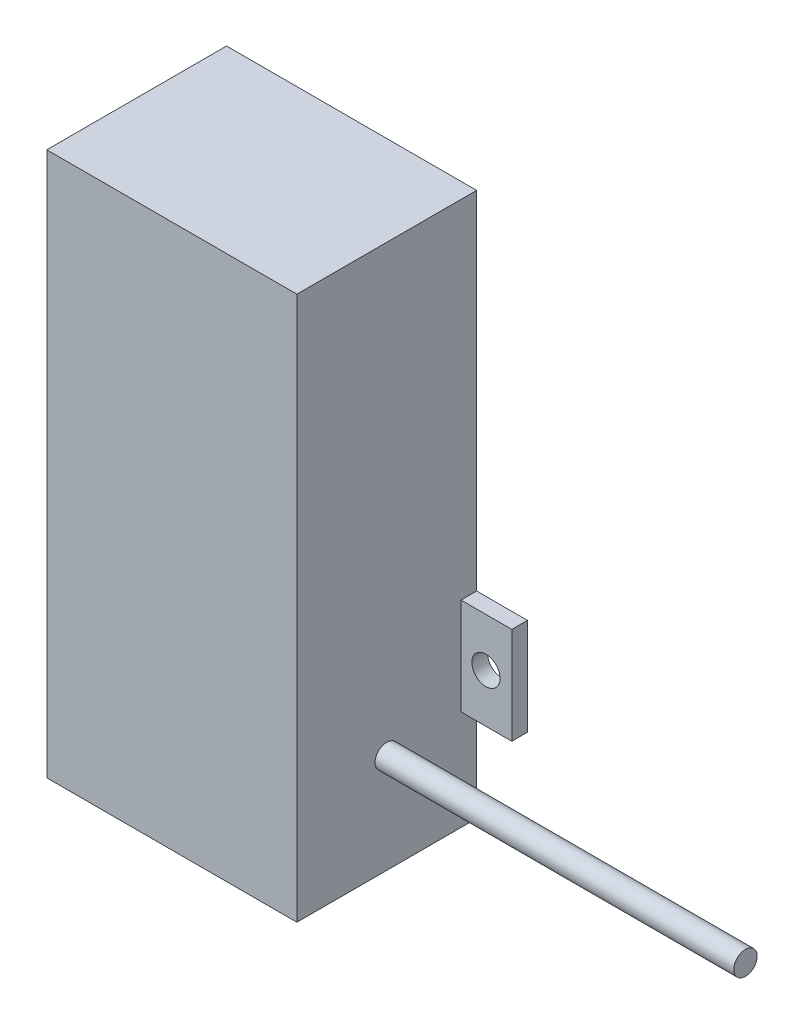
ISO-10303-21;
HEADER;
FILE_DESCRIPTION(('STEP AP214'),'2;1');
FILE_NAME('part.step','',(''),(''),'','','');
FILE_SCHEMA(('AUTOMOTIVE_DESIGN { 1 0 10303 214 1 1 1 1 }'));
ENDSEC;
DATA;
#1=APPLICATION_CONTEXT('core data for automotive mechanical design processes');
#2=APPLICATION_PROTOCOL_DEFINITION('international standard','automotive_design',2000,#1);
#3=PRODUCT_CONTEXT('',#1,'mechanical');
#4=PRODUCT('Part','Part','',(#3));
#5=PRODUCT_RELATED_PRODUCT_CATEGORY('part','',(#4));
#6=PRODUCT_DEFINITION_FORMATION('','',#4);
#7=PRODUCT_DEFINITION_CONTEXT('part definition',#1,'design');
#8=PRODUCT_DEFINITION('design','',#6,#7);
#9=PRODUCT_DEFINITION_SHAPE('','',#8);
#10=(LENGTH_UNIT() NAMED_UNIT(*) SI_UNIT(.MILLI.,.METRE.));
#11=(NAMED_UNIT(*) PLANE_ANGLE_UNIT() SI_UNIT($,.RADIAN.));
#12=(NAMED_UNIT(*) SI_UNIT($,.STERADIAN.) SOLID_ANGLE_UNIT());
#13=UNCERTAINTY_MEASURE_WITH_UNIT(LENGTH_MEASURE(1.E-05),#10,'distance_accuracy_value','');
#14=(GEOMETRIC_REPRESENTATION_CONTEXT(3) GLOBAL_UNCERTAINTY_ASSIGNED_CONTEXT((#13)) GLOBAL_UNIT_ASSIGNED_CONTEXT((#10,
#11,#12)) REPRESENTATION_CONTEXT('',''));
#15=CARTESIAN_POINT('',(0.,0.,0.));
#16=DIRECTION('',(0.,0.,1.));
#17=DIRECTION('',(1.,0.,0.));
#18=AXIS2_PLACEMENT_3D('',#15,#16,#17);
#19=CARTESIAN_POINT('',(34.2790620031797,29.2729411764706,23.));
#20=DIRECTION('',(-1.,0.,0.));
#21=DIRECTION('',(0.,0.,1.));
#22=AXIS2_PLACEMENT_3D('',#19,#20,#21);
#23=PLANE('',#22);
#24=DIRECTION('',(0.,-1.,0.));
#25=VECTOR('',#24,1.);
#26=CARTESIAN_POINT('',(34.2790620031797,-19.5220896505135,2.));
#27=LINE('',#26,#25);
#28=CARTESIAN_POINT('',(34.2790620031797,-15.1220896505135,2.));
#29=VERTEX_POINT('',#28);
#30=CARTESIAN_POINT('',(34.2790620031797,-28.4172027618297,2.));
#31=VERTEX_POINT('',#30);
#32=EDGE_CURVE('E157',#29,#31,#27,.T.);
#33=ORIENTED_EDGE('',*,*,#32,.T.);
#34=DIRECTION('',(0.,0.,1.));
#35=VECTOR('',#34,1.);
#36=CARTESIAN_POINT('',(34.2790620031797,-28.4172027618297,23.));
#37=LINE('',#36,#35);
#38=CARTESIAN_POINT('',(34.2790620031797,-28.4172027618297,0.));
#39=VERTEX_POINT('',#38);
#40=EDGE_CURVE('E11',#39,#31,#37,.T.);
#41=ORIENTED_EDGE('',*,*,#40,.F.);
#42=DIRECTION('',(0.,1.,0.));
#43=VECTOR('',#42,1.);
#44=CARTESIAN_POINT('',(34.2790620031797,29.2729411764706,0.));
#45=LINE('',#44,#43);
#46=CARTESIAN_POINT('',(34.2790620031797,-40.3270588235294,0.));
#47=VERTEX_POINT('',#46);
#48=EDGE_CURVE('E143',#47,#39,#45,.T.);
#49=ORIENTED_EDGE('',*,*,#48,.F.);
#50=DIRECTION('',(0.,0.,-1.));
#51=VECTOR('',#50,1.);
#52=CARTESIAN_POINT('',(34.2790620031797,-40.3270588235294,23.));
#53=LINE('',#52,#51);
#54=CARTESIAN_POINT('',(34.2790620031797,-40.3270588235294,23.));
#55=VERTEX_POINT('',#54);
#56=EDGE_CURVE('E171',#55,#47,#53,.T.);
#57=ORIENTED_EDGE('',*,*,#56,.F.);
#58=DIRECTION('',(0.,1.,0.));
#59=VECTOR('',#58,1.);
#60=CARTESIAN_POINT('',(34.2790620031797,29.2729411764706,23.));
#61=LINE('',#60,#59);
#62=CARTESIAN_POINT('',(34.2790620031797,29.2729411764706,23.));
#63=VERTEX_POINT('',#62);
#64=EDGE_CURVE('E168',#55,#63,#61,.T.);
#65=ORIENTED_EDGE('',*,*,#64,.T.);
#66=DIRECTION('',(0.,0.,-1.));
#67=VECTOR('',#66,1.);
#68=CARTESIAN_POINT('',(34.2790620031797,29.2729411764706,23.));
#69=LINE('',#68,#67);
#70=CARTESIAN_POINT('',(34.2790620031797,29.2729411764706,0.));
#71=VERTEX_POINT('',#70);
#72=EDGE_CURVE('E175',#63,#71,#69,.T.);
#73=ORIENTED_EDGE('',*,*,#72,.T.);
#74=CARTESIAN_POINT('',(34.2790620031797,-15.1220896505135,0.));
#75=VERTEX_POINT('',#74);
#76=EDGE_CURVE('E167',#75,#71,#45,.T.);
#77=ORIENTED_EDGE('',*,*,#76,.F.);
#78=DIRECTION('',(0.,0.,1.));
#79=VECTOR('',#78,1.);
#80=CARTESIAN_POINT('',(34.2790620031797,-15.1220896505135,0.));
#81=LINE('',#80,#79);
#82=EDGE_CURVE('E58',#75,#29,#81,.T.);
#83=ORIENTED_EDGE('',*,*,#82,.T.);
#84=EDGE_LOOP('',(#33,#41,#49,#57,#65,#73,#77,#83));
#85=FACE_BOUND('',#84,.T.);
#86=ADVANCED_FACE('F39',(#85),#23,.T.);
#87=CARTESIAN_POINT('',(66.2790620031797,29.2729411764706,23.));
#88=DIRECTION('',(-1.,0.,0.));
#89=DIRECTION('',(0.,0.,1.));
#90=AXIS2_PLACEMENT_3D('',#87,#88,#89);
#91=PLANE('',#90);
#92=CARTESIAN_POINT('',(66.2790620031797,-27.6270588235294,11.5));
#93=DIRECTION('',(-1.,0.,0.));
#94=DIRECTION('',(0.,0.,1.));
#95=AXIS2_PLACEMENT_3D('',#92,#93,#94);
#96=CIRCLE('',#95,1.5);
#97=CARTESIAN_POINT('',(66.2790620031797,-27.6270588235294,13.));
#98=VERTEX_POINT('',#97);
#99=EDGE_CURVE('E47',#98,#98,#96,.F.);
#100=ORIENTED_EDGE('',*,*,#99,.F.);
#101=EDGE_LOOP('',(#100));
#102=FACE_BOUND('',#101,.T.);
#103=DIRECTION('',(0.,0.,1.));
#104=VECTOR('',#103,1.);
#105=CARTESIAN_POINT('',(66.2790620031797,-27.5220896505135,0.));
#106=LINE('',#105,#104);
#107=CARTESIAN_POINT('',(66.2790620031797,-27.5220896505135,0.));
#108=VERTEX_POINT('',#107);
#109=CARTESIAN_POINT('',(66.2790620031797,-27.5220896505135,2.));
#110=VERTEX_POINT('',#109);
#111=EDGE_CURVE('E178',#108,#110,#106,.T.);
#112=ORIENTED_EDGE('',*,*,#111,.T.);
#113=DIRECTION('',(0.,-1.,0.));
#114=VECTOR('',#113,1.);
#115=CARTESIAN_POINT('',(66.2790620031797,-19.5220896505135,2.));
#116=LINE('',#115,#114);
#117=CARTESIAN_POINT('',(66.2790620031797,-15.1220896505135,2.));
#118=VERTEX_POINT('',#117);
#119=EDGE_CURVE('E195',#118,#110,#116,.T.);
#120=ORIENTED_EDGE('',*,*,#119,.F.);
#121=DIRECTION('',(0.,0.,1.));
#122=VECTOR('',#121,1.);
#123=CARTESIAN_POINT('',(66.2790620031797,-15.1220896505135,0.));
#124=LINE('',#123,#122);
#125=CARTESIAN_POINT('',(66.2790620031797,-15.1220896505135,0.));
#126=VERTEX_POINT('',#125);
#127=EDGE_CURVE('E190',#126,#118,#124,.T.);
#128=ORIENTED_EDGE('',*,*,#127,.F.);
#129=DIRECTION('',(0.,1.,0.));
#130=VECTOR('',#129,1.);
#131=CARTESIAN_POINT('',(66.2790620031797,29.2729411764706,0.));
#132=LINE('',#131,#130);
#133=CARTESIAN_POINT('',(66.2790620031797,29.2729411764706,0.));
#134=VERTEX_POINT('',#133);
#135=EDGE_CURVE('E219',#126,#134,#132,.T.);
#136=ORIENTED_EDGE('',*,*,#135,.T.);
#137=DIRECTION('',(0.,0.,-1.));
#138=VECTOR('',#137,1.);
#139=CARTESIAN_POINT('',(66.2790620031797,29.2729411764706,23.));
#140=LINE('',#139,#138);
#141=CARTESIAN_POINT('',(66.2790620031797,29.2729411764706,23.));
#142=VERTEX_POINT('',#141);
#143=EDGE_CURVE('E217',#142,#134,#140,.T.);
#144=ORIENTED_EDGE('',*,*,#143,.F.);
#145=DIRECTION('',(0.,1.,0.));
#146=VECTOR('',#145,1.);
#147=CARTESIAN_POINT('',(66.2790620031797,29.2729411764706,23.));
#148=LINE('',#147,#146);
#149=CARTESIAN_POINT('',(66.2790620031797,-40.3270588235294,23.));
#150=VERTEX_POINT('',#149);
#151=EDGE_CURVE('E212',#150,#142,#148,.T.);
#152=ORIENTED_EDGE('',*,*,#151,.F.);
#153=DIRECTION('',(0.,0.,-1.));
#154=VECTOR('',#153,1.);
#155=CARTESIAN_POINT('',(66.2790620031797,-40.3270588235294,23.));
#156=LINE('',#155,#154);
#157=CARTESIAN_POINT('',(66.2790620031797,-40.3270588235294,0.));
#158=VERTEX_POINT('',#157);
#159=EDGE_CURVE('E226',#150,#158,#156,.T.);
#160=ORIENTED_EDGE('',*,*,#159,.T.);
#161=EDGE_CURVE('E220',#158,#108,#132,.T.);
#162=ORIENTED_EDGE('',*,*,#161,.T.);
#163=EDGE_LOOP('',(#112,#120,#128,#136,#144,#152,#160,#162));
#164=FACE_BOUND('',#163,.T.);
#165=ADVANCED_FACE('F233',(#102,#164),#91,.F.);
#166=CARTESIAN_POINT('',(0.,0.,0.));
#167=DIRECTION('',(0.,0.,1.));
#168=DIRECTION('',(1.,0.,0.));
#169=AXIS2_PLACEMENT_3D('',#166,#167,#168);
#170=PLANE('',#169);
#171=CARTESIAN_POINT('',(31.0771714081852,-21.7720896505135,0.));
#172=DIRECTION('',(0.,0.,1.));
#173=DIRECTION('',(1.,0.,0.));
#174=AXIS2_PLACEMENT_3D('',#171,#172,#173);
#175=CIRCLE('',#174,1.79810940500553);
#176=CARTESIAN_POINT('',(32.8752808131908,-21.7720896505135,0.));
#177=VERTEX_POINT('',#176);
#178=EDGE_CURVE('E309',#177,#177,#175,.T.);
#179=ORIENTED_EDGE('',*,*,#178,.T.);
#180=EDGE_LOOP('',(#179));
#181=FACE_BOUND('',#180,.T.);
#182=ORIENTED_EDGE('',*,*,#48,.T.);
#183=DIRECTION('',(-1.,0.,0.));
#184=VECTOR('',#183,1.);
#185=CARTESIAN_POINT('',(35.2790620031797,-28.4172027618297,0.));
#186=LINE('',#185,#184);
#187=CARTESIAN_POINT('',(27.7790620031797,-28.4172027618297,0.));
#188=VERTEX_POINT('',#187);
#189=EDGE_CURVE('E140',#39,#188,#186,.T.);
#190=ORIENTED_EDGE('',*,*,#189,.T.);
#191=DIRECTION('',(0.,1.,0.));
#192=VECTOR('',#191,1.);
#193=CARTESIAN_POINT('',(27.7790620031797,-19.5220896505135,0.));
#194=LINE('',#193,#192);
#195=CARTESIAN_POINT('',(27.7790620031797,-15.1220896505135,0.));
#196=VERTEX_POINT('',#195);
#197=EDGE_CURVE('E127',#188,#196,#194,.T.);
#198=ORIENTED_EDGE('',*,*,#197,.T.);
#199=DIRECTION('',(1.,0.,0.));
#200=VECTOR('',#199,1.);
#201=CARTESIAN_POINT('',(27.7790620031797,-15.1220896505135,0.));
#202=LINE('',#201,#200);
#203=EDGE_CURVE('E161',#196,#75,#202,.T.);
#204=ORIENTED_EDGE('',*,*,#203,.T.);
#205=ORIENTED_EDGE('',*,*,#76,.T.);
#206=DIRECTION('',(-1.,0.,0.));
#207=VECTOR('',#206,1.);
#208=CARTESIAN_POINT('',(34.2790620031797,29.2729411764706,0.));
#209=LINE('',#208,#207);
#210=EDGE_CURVE('E213',#134,#71,#209,.T.);
#211=ORIENTED_EDGE('',*,*,#210,.F.);
#212=ORIENTED_EDGE('',*,*,#135,.F.);
#213=DIRECTION('',(-1.,0.,0.));
#214=VECTOR('',#213,1.);
#215=CARTESIAN_POINT('',(72.7790620031797,-15.1220896505135,0.));
#216=LINE('',#215,#214);
#217=CARTESIAN_POINT('',(72.7790620031797,-15.1220896505135,0.));
#218=VERTEX_POINT('',#217);
#219=EDGE_CURVE('E204',#218,#126,#216,.T.);
#220=ORIENTED_EDGE('',*,*,#219,.F.);
#221=DIRECTION('',(0.,1.,0.));
#222=VECTOR('',#221,1.);
#223=CARTESIAN_POINT('',(72.7790620031797,-19.5220896505135,0.));
#224=LINE('',#223,#222);
#225=CARTESIAN_POINT('',(72.7790620031797,-27.5220896505135,0.));
#226=VERTEX_POINT('',#225);
#227=EDGE_CURVE('E191',#226,#218,#224,.T.);
#228=ORIENTED_EDGE('',*,*,#227,.F.);
#229=DIRECTION('',(-1.,0.,0.));
#230=VECTOR('',#229,1.);
#231=CARTESIAN_POINT('',(72.7790620031797,-27.5220896505135,0.));
#232=LINE('',#231,#230);
#233=EDGE_CURVE('E182',#226,#108,#232,.T.);
#234=ORIENTED_EDGE('',*,*,#233,.T.);
#235=ORIENTED_EDGE('',*,*,#161,.F.);
#236=DIRECTION('',(1.,0.,0.));
#237=VECTOR('',#236,1.);
#238=CARTESIAN_POINT('',(34.2790620031797,-40.3270588235294,0.));
#239=LINE('',#238,#237);
#240=EDGE_CURVE('E209',#47,#158,#239,.T.);
#241=ORIENTED_EDGE('',*,*,#240,.F.);
#242=EDGE_LOOP('',(#182,#190,#198,#204,#205,#211,#212,#220,#228,#234,#235,#241));
#243=FACE_BOUND('',#242,.T.);
#244=CARTESIAN_POINT('',(69.4772948209206,-21.3220896505135,0.));
#245=DIRECTION('',(0.,0.,1.));
#246=DIRECTION('',(1.,0.,0.));
#247=AXIS2_PLACEMENT_3D('',#244,#245,#246);
#248=CIRCLE('',#247,1.80176718225915);
#249=CARTESIAN_POINT('',(71.2790620031797,-21.3220896505135,0.));
#250=VERTEX_POINT('',#249);
#251=EDGE_CURVE('E150',#250,#250,#248,.T.);
#252=ORIENTED_EDGE('',*,*,#251,.T.);
#253=EDGE_LOOP('',(#252));
#254=FACE_BOUND('',#253,.T.);
#255=ADVANCED_FACE('F141',(#181,#243,#254),#170,.F.);
#256=CARTESIAN_POINT('',(34.2790620031797,-40.3270588235294,23.));
#257=DIRECTION('',(0.,1.,0.));
#258=DIRECTION('',(0.,0.,1.));
#259=AXIS2_PLACEMENT_3D('',#256,#257,#258);
#260=PLANE('',#259);
#261=DIRECTION('',(1.,0.,0.));
#262=VECTOR('',#261,1.);
#263=CARTESIAN_POINT('',(34.2790620031797,-40.3270588235294,23.));
#264=LINE('',#263,#262);
#265=EDGE_CURVE('E210',#55,#150,#264,.T.);
#266=ORIENTED_EDGE('',*,*,#265,.F.);
#267=ORIENTED_EDGE('',*,*,#56,.T.);
#268=ORIENTED_EDGE('',*,*,#240,.T.);
#269=ORIENTED_EDGE('',*,*,#159,.F.);
#270=EDGE_LOOP('',(#266,#267,#268,#269));
#271=FACE_BOUND('',#270,.T.);
#272=ADVANCED_FACE('F41',(#271),#260,.F.);
#273=CARTESIAN_POINT('',(34.2790620031797,29.2729411764706,23.));
#274=DIRECTION('',(0.,-1.,0.));
#275=DIRECTION('',(0.,0.,-1.));
#276=AXIS2_PLACEMENT_3D('',#273,#274,#275);
#277=PLANE('',#276);
#278=ORIENTED_EDGE('',*,*,#210,.T.);
#279=ORIENTED_EDGE('',*,*,#72,.F.);
#280=DIRECTION('',(-1.,0.,0.));
#281=VECTOR('',#280,1.);
#282=CARTESIAN_POINT('',(34.2790620031797,29.2729411764706,23.));
#283=LINE('',#282,#281);
#284=EDGE_CURVE('E215',#142,#63,#283,.T.);
#285=ORIENTED_EDGE('',*,*,#284,.F.);
#286=ORIENTED_EDGE('',*,*,#143,.T.);
#287=EDGE_LOOP('',(#278,#279,#285,#286));
#288=FACE_BOUND('',#287,.T.);
#289=ADVANCED_FACE('F257',(#288),#277,.F.);
#290=CARTESIAN_POINT('',(0.,0.,23.));
#291=DIRECTION('',(0.,0.,1.));
#292=DIRECTION('',(1.,0.,0.));
#293=AXIS2_PLACEMENT_3D('',#290,#291,#292);
#294=PLANE('',#293);
#295=ORIENTED_EDGE('',*,*,#284,.T.);
#296=ORIENTED_EDGE('',*,*,#64,.F.);
#297=ORIENTED_EDGE('',*,*,#265,.T.);
#298=ORIENTED_EDGE('',*,*,#151,.T.);
#299=EDGE_LOOP('',(#295,#296,#297,#298));
#300=FACE_BOUND('',#299,.T.);
#301=ADVANCED_FACE('F262',(#300),#294,.T.);
#302=CARTESIAN_POINT('',(112.17906200318,-27.6270588235294,11.5));
#303=DIRECTION('',(-1.,0.,0.));
#304=DIRECTION('',(0.,0.,1.));
#305=AXIS2_PLACEMENT_3D('',#302,#303,#304);
#306=CYLINDRICAL_SURFACE('',#305,1.5);
#307=CARTESIAN_POINT('',(112.17906200318,-27.6270588235294,11.5));
#308=DIRECTION('',(1.,0.,0.));
#309=DIRECTION('',(0.,0.,-1.));
#310=AXIS2_PLACEMENT_3D('',#307,#308,#309);
#311=CIRCLE('',#310,1.5);
#312=CARTESIAN_POINT('',(112.17906200318,-27.6270588235294,10.));
#313=VERTEX_POINT('',#312);
#314=EDGE_CURVE('E206',#313,#313,#311,.T.);
#315=ORIENTED_EDGE('',*,*,#314,.F.);
#316=EDGE_LOOP('',(#315));
#317=FACE_BOUND('',#316,.T.);
#318=ORIENTED_EDGE('',*,*,#99,.T.);
#319=EDGE_LOOP('',(#318));
#320=FACE_BOUND('',#319,.T.);
#321=ADVANCED_FACE('F231',(#317,#320),#306,.T.);
#322=CARTESIAN_POINT('',(112.17906200318,0.,0.));
#323=DIRECTION('',(1.,0.,0.));
#324=DIRECTION('',(0.,0.,-1.));
#325=AXIS2_PLACEMENT_3D('',#322,#323,#324);
#326=PLANE('',#325);
#327=ORIENTED_EDGE('',*,*,#314,.T.);
#328=EDGE_LOOP('',(#327));
#329=FACE_BOUND('',#328,.T.);
#330=ADVANCED_FACE('F332',(#329),#326,.T.);
#331=CARTESIAN_POINT('',(72.7790620031797,-15.1220896505135,0.));
#332=DIRECTION('',(0.,-1.,0.));
#333=DIRECTION('',(0.,0.,-1.));
#334=AXIS2_PLACEMENT_3D('',#331,#332,#333);
#335=PLANE('',#334);
#336=ORIENTED_EDGE('',*,*,#127,.T.);
#337=DIRECTION('',(-1.,0.,0.));
#338=VECTOR('',#337,1.);
#339=CARTESIAN_POINT('',(72.7790620031797,-15.1220896505135,2.));
#340=LINE('',#339,#338);
#341=CARTESIAN_POINT('',(72.7790620031797,-15.1220896505135,2.));
#342=VERTEX_POINT('',#341);
#343=EDGE_CURVE('E199',#342,#118,#340,.T.);
#344=ORIENTED_EDGE('',*,*,#343,.F.);
#345=DIRECTION('',(0.,0.,1.));
#346=VECTOR('',#345,1.);
#347=CARTESIAN_POINT('',(72.7790620031797,-15.1220896505135,0.));
#348=LINE('',#347,#346);
#349=EDGE_CURVE('E194',#218,#342,#348,.T.);
#350=ORIENTED_EDGE('',*,*,#349,.F.);
#351=ORIENTED_EDGE('',*,*,#219,.T.);
#352=EDGE_LOOP('',(#336,#344,#350,#351));
#353=FACE_BOUND('',#352,.T.);
#354=ADVANCED_FACE('F250',(#353),#335,.F.);
#355=CARTESIAN_POINT('',(72.7790620031797,-19.5220896505135,2.));
#356=DIRECTION('',(0.,0.,-1.));
#357=DIRECTION('',(-1.,0.,0.));
#358=AXIS2_PLACEMENT_3D('',#355,#356,#357);
#359=PLANE('',#358);
#360=CARTESIAN_POINT('',(69.4772948209206,-21.3220896505135,2.));
#361=DIRECTION('',(0.,0.,1.));
#362=DIRECTION('',(1.,0.,0.));
#363=AXIS2_PLACEMENT_3D('',#360,#361,#362);
#364=CIRCLE('',#363,1.80176718225915);
#365=CARTESIAN_POINT('',(71.2790620031797,-21.3220896505135,2.));
#366=VERTEX_POINT('',#365);
#367=EDGE_CURVE('E153',#366,#366,#364,.T.);
#368=ORIENTED_EDGE('',*,*,#367,.F.);
#369=EDGE_LOOP('',(#368));
#370=FACE_BOUND('',#369,.T.);
#371=ORIENTED_EDGE('',*,*,#119,.T.);
#372=DIRECTION('',(-1.,0.,0.));
#373=VECTOR('',#372,1.);
#374=CARTESIAN_POINT('',(72.7790620031797,-27.5220896505135,2.));
#375=LINE('',#374,#373);
#376=CARTESIAN_POINT('',(72.7790620031797,-27.5220896505135,2.));
#377=VERTEX_POINT('',#376);
#378=EDGE_CURVE('E187',#377,#110,#375,.T.);
#379=ORIENTED_EDGE('',*,*,#378,.F.);
#380=DIRECTION('',(0.,-1.,0.));
#381=VECTOR('',#380,1.);
#382=CARTESIAN_POINT('',(72.7790620031797,-19.5220896505135,2.));
#383=LINE('',#382,#381);
#384=EDGE_CURVE('E197',#342,#377,#383,.T.);
#385=ORIENTED_EDGE('',*,*,#384,.F.);
#386=ORIENTED_EDGE('',*,*,#343,.T.);
#387=EDGE_LOOP('',(#371,#379,#385,#386));
#388=FACE_BOUND('',#387,.T.);
#389=ADVANCED_FACE('F247',(#370,#388),#359,.F.);
#390=CARTESIAN_POINT('',(72.7790620031797,0.,0.));
#391=DIRECTION('',(1.,0.,0.));
#392=DIRECTION('',(0.,0.,-1.));
#393=AXIS2_PLACEMENT_3D('',#390,#391,#392);
#394=PLANE('',#393);
#395=ORIENTED_EDGE('',*,*,#227,.T.);
#396=ORIENTED_EDGE('',*,*,#349,.T.);
#397=ORIENTED_EDGE('',*,*,#384,.T.);
#398=DIRECTION('',(0.,0.,1.));
#399=VECTOR('',#398,1.);
#400=CARTESIAN_POINT('',(72.7790620031797,-27.5220896505135,0.));
#401=LINE('',#400,#399);
#402=EDGE_CURVE('E179',#226,#377,#401,.T.);
#403=ORIENTED_EDGE('',*,*,#402,.F.);
#404=EDGE_LOOP('',(#395,#396,#397,#403));
#405=FACE_BOUND('',#404,.T.);
#406=ADVANCED_FACE('F267',(#405),#394,.T.);
#407=CARTESIAN_POINT('',(72.7790620031797,-27.5220896505135,0.));
#408=DIRECTION('',(0.,-1.,0.));
#409=DIRECTION('',(0.,0.,-1.));
#410=AXIS2_PLACEMENT_3D('',#407,#408,#409);
#411=PLANE('',#410);
#412=ORIENTED_EDGE('',*,*,#111,.F.);
#413=ORIENTED_EDGE('',*,*,#233,.F.);
#414=ORIENTED_EDGE('',*,*,#402,.T.);
#415=ORIENTED_EDGE('',*,*,#378,.T.);
#416=EDGE_LOOP('',(#412,#413,#414,#415));
#417=FACE_BOUND('',#416,.T.);
#418=ADVANCED_FACE('F243',(#417),#411,.T.);
#419=CARTESIAN_POINT('',(27.7790620031797,-19.5220896505135,2.));
#420=DIRECTION('',(0.,0.,1.));
#421=DIRECTION('',(1.,0.,0.));
#422=AXIS2_PLACEMENT_3D('',#419,#420,#421);
#423=PLANE('',#422);
#424=CARTESIAN_POINT('',(31.0771714081852,-21.7720896505135,2.));
#425=DIRECTION('',(0.,0.,1.));
#426=DIRECTION('',(1.,0.,0.));
#427=AXIS2_PLACEMENT_3D('',#424,#425,#426);
#428=CIRCLE('',#427,1.79810940500553);
#429=CARTESIAN_POINT('',(32.8752808131908,-21.7720896505135,2.));
#430=VERTEX_POINT('',#429);
#431=EDGE_CURVE('E306',#430,#430,#428,.T.);
#432=ORIENTED_EDGE('',*,*,#431,.F.);
#433=EDGE_LOOP('',(#432));
#434=FACE_BOUND('',#433,.T.);
#435=DIRECTION('',(-1.,0.,0.));
#436=VECTOR('',#435,1.);
#437=CARTESIAN_POINT('',(35.2790620031797,-28.4172027618297,2.));
#438=LINE('',#437,#436);
#439=CARTESIAN_POINT('',(27.7790620031797,-28.4172027618297,2.));
#440=VERTEX_POINT('',#439);
#441=EDGE_CURVE('E145',#31,#440,#438,.T.);
#442=ORIENTED_EDGE('',*,*,#441,.F.);
#443=ORIENTED_EDGE('',*,*,#32,.F.);
#444=DIRECTION('',(1.,0.,0.));
#445=VECTOR('',#444,1.);
#446=CARTESIAN_POINT('',(27.7790620031797,-15.1220896505135,2.));
#447=LINE('',#446,#445);
#448=CARTESIAN_POINT('',(27.7790620031797,-15.1220896505135,2.));
#449=VERTEX_POINT('',#448);
#450=EDGE_CURVE('E165',#449,#29,#447,.T.);
#451=ORIENTED_EDGE('',*,*,#450,.F.);
#452=DIRECTION('',(0.,-1.,0.));
#453=VECTOR('',#452,1.);
#454=CARTESIAN_POINT('',(27.7790620031797,-19.5220896505135,2.));
#455=LINE('',#454,#453);
#456=EDGE_CURVE('E137',#449,#440,#455,.T.);
#457=ORIENTED_EDGE('',*,*,#456,.T.);
#458=EDGE_LOOP('',(#442,#443,#451,#457));
#459=FACE_BOUND('',#458,.T.);
#460=ADVANCED_FACE('F274',(#434,#459),#423,.T.);
#461=CARTESIAN_POINT('',(27.7790620031797,-15.1220896505135,0.));
#462=DIRECTION('',(0.,1.,0.));
#463=DIRECTION('',(0.,0.,1.));
#464=AXIS2_PLACEMENT_3D('',#461,#462,#463);
#465=PLANE('',#464);
#466=ORIENTED_EDGE('',*,*,#82,.F.);
#467=ORIENTED_EDGE('',*,*,#203,.F.);
#468=DIRECTION('',(0.,0.,1.));
#469=VECTOR('',#468,1.);
#470=CARTESIAN_POINT('',(27.7790620031797,-15.1220896505135,0.));
#471=LINE('',#470,#469);
#472=EDGE_CURVE('E134',#196,#449,#471,.T.);
#473=ORIENTED_EDGE('',*,*,#472,.T.);
#474=ORIENTED_EDGE('',*,*,#450,.T.);
#475=EDGE_LOOP('',(#466,#467,#473,#474));
#476=FACE_BOUND('',#475,.T.);
#477=ADVANCED_FACE('F285',(#476),#465,.T.);
#478=CARTESIAN_POINT('',(27.7790620031797,0.,0.));
#479=DIRECTION('',(-1.,0.,0.));
#480=DIRECTION('',(0.,0.,-1.));
#481=AXIS2_PLACEMENT_3D('',#478,#479,#480);
#482=PLANE('',#481);
#483=ORIENTED_EDGE('',*,*,#197,.F.);
#484=DIRECTION('',(0.,0.,1.));
#485=VECTOR('',#484,1.);
#486=CARTESIAN_POINT('',(27.7790620031797,-28.4172027618297,0.));
#487=LINE('',#486,#485);
#488=EDGE_CURVE('E132',#188,#440,#487,.T.);
#489=ORIENTED_EDGE('',*,*,#488,.T.);
#490=ORIENTED_EDGE('',*,*,#456,.F.);
#491=ORIENTED_EDGE('',*,*,#472,.F.);
#492=EDGE_LOOP('',(#483,#489,#490,#491));
#493=FACE_BOUND('',#492,.T.);
#494=ADVANCED_FACE('F129',(#493),#482,.T.);
#495=CARTESIAN_POINT('',(35.2790620031797,-28.4172027618297,0.));
#496=DIRECTION('',(0.,-1.,0.));
#497=DIRECTION('',(0.,0.,-1.));
#498=AXIS2_PLACEMENT_3D('',#495,#496,#497);
#499=PLANE('',#498);
#500=ORIENTED_EDGE('',*,*,#189,.F.);
#501=ORIENTED_EDGE('',*,*,#40,.T.);
#502=ORIENTED_EDGE('',*,*,#441,.T.);
#503=ORIENTED_EDGE('',*,*,#488,.F.);
#504=EDGE_LOOP('',(#500,#501,#502,#503));
#505=FACE_BOUND('',#504,.T.);
#506=ADVANCED_FACE('F148',(#505),#499,.T.);
#507=CARTESIAN_POINT('',(69.4772948209206,-21.3220896505135,-4.));
#508=DIRECTION('',(0.,0.,1.));
#509=DIRECTION('',(1.,0.,0.));
#510=AXIS2_PLACEMENT_3D('',#507,#508,#509);
#511=CYLINDRICAL_SURFACE('',#510,1.80176718225915);
#512=ORIENTED_EDGE('',*,*,#367,.T.);
#513=EDGE_LOOP('',(#512));
#514=FACE_BOUND('',#513,.T.);
#515=ORIENTED_EDGE('',*,*,#251,.F.);
#516=EDGE_LOOP('',(#515));
#517=FACE_BOUND('',#516,.T.);
#518=ADVANCED_FACE('F294',(#514,#517),#511,.F.);
#519=CARTESIAN_POINT('',(31.0771714081852,-21.7720896505135,-4.));
#520=DIRECTION('',(0.,0.,1.));
#521=DIRECTION('',(1.,0.,0.));
#522=AXIS2_PLACEMENT_3D('',#519,#520,#521);
#523=CYLINDRICAL_SURFACE('',#522,1.79810940500553);
#524=ORIENTED_EDGE('',*,*,#431,.T.);
#525=EDGE_LOOP('',(#524));
#526=FACE_BOUND('',#525,.T.);
#527=ORIENTED_EDGE('',*,*,#178,.F.);
#528=EDGE_LOOP('',(#527));
#529=FACE_BOUND('',#528,.T.);
#530=ADVANCED_FACE('F297',(#526,#529),#523,.F.);
#531=CLOSED_SHELL('',(#86,#165,#255,#272,#289,#301,#321,#330,#354,#389,#406,#418,#460,#477,#494,
#506,#518,#530));
#532=MANIFOLD_SOLID_BREP('B2',#531);
#533=ADVANCED_BREP_SHAPE_REPRESENTATION('',(#18,#532),#14);
#534=SHAPE_DEFINITION_REPRESENTATION(#9,#533);
ENDSEC;
END-ISO-10303-21;
